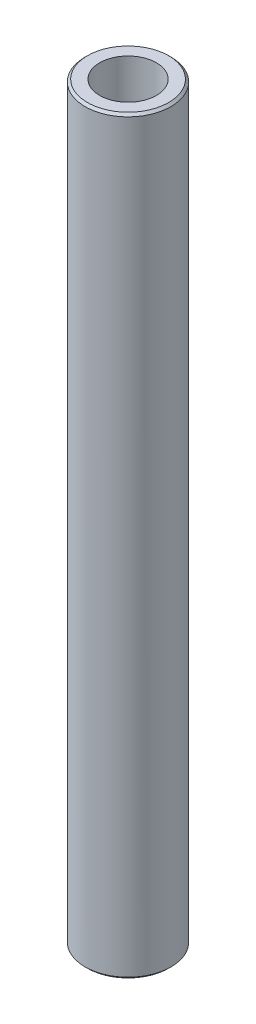
ISO-10303-21;
HEADER;
FILE_DESCRIPTION(('STEP AP214'),'2;1');
FILE_NAME('part.step','',(''),(''),'','','');
FILE_SCHEMA(('AUTOMOTIVE_DESIGN { 1 0 10303 214 1 1 1 1 }'));
ENDSEC;
DATA;
#1=APPLICATION_CONTEXT('core data for automotive mechanical design processes');
#2=APPLICATION_PROTOCOL_DEFINITION('international standard','automotive_design',2000,#1);
#3=PRODUCT_CONTEXT('',#1,'mechanical');
#4=PRODUCT('Part','Part','',(#3));
#5=PRODUCT_RELATED_PRODUCT_CATEGORY('part','',(#4));
#6=PRODUCT_DEFINITION_FORMATION('','',#4);
#7=PRODUCT_DEFINITION_CONTEXT('part definition',#1,'design');
#8=PRODUCT_DEFINITION('design','',#6,#7);
#9=PRODUCT_DEFINITION_SHAPE('','',#8);
#10=(LENGTH_UNIT() NAMED_UNIT(*) SI_UNIT(.MILLI.,.METRE.));
#11=(NAMED_UNIT(*) PLANE_ANGLE_UNIT() SI_UNIT($,.RADIAN.));
#12=(NAMED_UNIT(*) SI_UNIT($,.STERADIAN.) SOLID_ANGLE_UNIT());
#13=UNCERTAINTY_MEASURE_WITH_UNIT(LENGTH_MEASURE(1.E-05),#10,'distance_accuracy_value','');
#14=(GEOMETRIC_REPRESENTATION_CONTEXT(3) GLOBAL_UNCERTAINTY_ASSIGNED_CONTEXT((#13)) GLOBAL_UNIT_ASSIGNED_CONTEXT((#10,
#11,#12)) REPRESENTATION_CONTEXT('',''));
#15=CARTESIAN_POINT('',(0.,0.,0.));
#16=DIRECTION('',(0.,0.,1.));
#17=DIRECTION('',(1.,0.,0.));
#18=AXIS2_PLACEMENT_3D('',#15,#16,#17);
#19=CARTESIAN_POINT('',(0.,480.079677368258,0.));
#20=DIRECTION('',(0.,-1.,0.));
#21=DIRECTION('',(0.,0.,-1.));
#22=AXIS2_PLACEMENT_3D('',#19,#20,#21);
#23=CYLINDRICAL_SURFACE('',#22,27.5);
#24=CARTESIAN_POINT('',(0.,478.569611475824,0.));
#25=DIRECTION('',(0.,1.,0.));
#26=DIRECTION('',(0.,0.,1.));
#27=AXIS2_PLACEMENT_3D('',#24,#25,#26);
#28=CIRCLE('',#27,27.5);
#29=CARTESIAN_POINT('',(0.,478.569611475824,-27.5));
#30=VERTEX_POINT('',#29);
#31=EDGE_CURVE('E50',#30,#30,#28,.F.);
#32=ORIENTED_EDGE('',*,*,#31,.T.);
#33=EDGE_LOOP('',(#32));
#34=FACE_BOUND('',#33,.T.);
#35=CARTESIAN_POINT('',(0.,1.51006589243341,0.));
#36=DIRECTION('',(0.,1.,0.));
#37=DIRECTION('',(0.,0.,1.));
#38=AXIS2_PLACEMENT_3D('',#35,#36,#37);
#39=CIRCLE('',#38,27.5);
#40=CARTESIAN_POINT('',(0.,1.51006589243341,27.5));
#41=VERTEX_POINT('',#40);
#42=EDGE_CURVE('E51',#41,#41,#39,.T.);
#43=ORIENTED_EDGE('',*,*,#42,.T.);
#44=EDGE_LOOP('',(#43));
#45=FACE_BOUND('',#44,.T.);
#46=ADVANCED_FACE('F39',(#34,#45),#23,.T.);
#47=CARTESIAN_POINT('',(0.,480.079677368258,0.));
#48=DIRECTION('',(0.,1.,0.));
#49=DIRECTION('',(0.,0.,1.));
#50=AXIS2_PLACEMENT_3D('',#47,#48,#49);
#51=PLANE('',#50);
#52=CARTESIAN_POINT('',(0.,480.079677368258,0.));
#53=DIRECTION('',(0.,1.,0.));
#54=DIRECTION('',(0.,0.,1.));
#55=AXIS2_PLACEMENT_3D('',#52,#53,#54);
#56=CIRCLE('',#55,25.9899341075666);
#57=CARTESIAN_POINT('',(0.,480.079677368258,-25.9899341075666));
#58=VERTEX_POINT('',#57);
#59=EDGE_CURVE('E54',#58,#58,#56,.T.);
#60=ORIENTED_EDGE('',*,*,#59,.T.);
#61=EDGE_LOOP('',(#60));
#62=FACE_BOUND('',#61,.T.);
#63=CARTESIAN_POINT('',(0.,480.079677368258,0.));
#64=DIRECTION('',(0.,1.,0.));
#65=DIRECTION('',(0.,0.,1.));
#66=AXIS2_PLACEMENT_3D('',#63,#64,#65);
#67=CIRCLE('',#66,18.1618123295571);
#68=CARTESIAN_POINT('',(0.,480.079677368258,18.1618123295571));
#69=VERTEX_POINT('',#68);
#70=EDGE_CURVE('E58',#69,#69,#67,.T.);
#71=ORIENTED_EDGE('',*,*,#70,.F.);
#72=EDGE_LOOP('',(#71));
#73=FACE_BOUND('',#72,.T.);
#74=ADVANCED_FACE('F69',(#62,#73),#51,.T.);
#75=CARTESIAN_POINT('',(0.,0.,0.));
#76=DIRECTION('',(0.,1.,0.));
#77=DIRECTION('',(0.,0.,1.));
#78=AXIS2_PLACEMENT_3D('',#75,#76,#77);
#79=PLANE('',#78);
#80=CARTESIAN_POINT('',(0.,0.,0.));
#81=DIRECTION('',(0.,1.,0.));
#82=DIRECTION('',(0.,0.,1.));
#83=AXIS2_PLACEMENT_3D('',#80,#81,#82);
#84=CIRCLE('',#83,25.9899341075666);
#85=CARTESIAN_POINT('',(0.,0.,25.9899341075666));
#86=VERTEX_POINT('',#85);
#87=EDGE_CURVE('E10',#86,#86,#84,.F.);
#88=ORIENTED_EDGE('',*,*,#87,.T.);
#89=EDGE_LOOP('',(#88));
#90=FACE_BOUND('',#89,.T.);
#91=CARTESIAN_POINT('',(0.,0.,0.));
#92=DIRECTION('',(0.,1.,0.));
#93=DIRECTION('',(0.,0.,1.));
#94=AXIS2_PLACEMENT_3D('',#91,#92,#93);
#95=CIRCLE('',#94,18.1618123295571);
#96=CARTESIAN_POINT('',(0.,0.,18.1618123295571));
#97=VERTEX_POINT('',#96);
#98=EDGE_CURVE('E63',#97,#97,#95,.T.);
#99=ORIENTED_EDGE('',*,*,#98,.T.);
#100=EDGE_LOOP('',(#99));
#101=FACE_BOUND('',#100,.T.);
#102=ADVANCED_FACE('F75',(#90,#101),#79,.F.);
#103=CARTESIAN_POINT('',(0.,480.079677368258,0.));
#104=DIRECTION('',(0.,-1.,0.));
#105=DIRECTION('',(0.,0.,-1.));
#106=AXIS2_PLACEMENT_3D('',#103,#104,#105);
#107=CYLINDRICAL_SURFACE('',#106,18.1618123295571);
#108=ORIENTED_EDGE('',*,*,#70,.T.);
#109=EDGE_LOOP('',(#108));
#110=FACE_BOUND('',#109,.T.);
#111=ORIENTED_EDGE('',*,*,#98,.F.);
#112=EDGE_LOOP('',(#111));
#113=FACE_BOUND('',#112,.T.);
#114=ADVANCED_FACE('F70',(#110,#113),#107,.F.);
#115=CARTESIAN_POINT('',(0.,480.079677368258,0.));
#116=DIRECTION('',(0.,-1.,0.));
#117=DIRECTION('',(0.,0.,-1.));
#118=AXIS2_PLACEMENT_3D('',#115,#116,#117);
#119=CONICAL_SURFACE('',#118,25.9899341075666,0.785398163397423);
#120=CARTESIAN_POINT('',(0.,478.569611475824,-27.5));
#121=CARTESIAN_POINT('',(0.,478.58534132887,-27.4842701469538));
#122=CARTESIAN_POINT('',(0.,478.601071181917,-27.4685402939077));
#123=CARTESIAN_POINT('',(0.,478.632530888009,-27.4370805878153));
#124=CARTESIAN_POINT('',(0.,478.648260741055,-27.4213507347691));
#125=CARTESIAN_POINT('',(0.,478.679720447148,-27.3898910286768));
#126=CARTESIAN_POINT('',(0.,478.695450300194,-27.3741611756306));
#127=CARTESIAN_POINT('',(0.,478.726910006286,-27.3427014695382));
#128=CARTESIAN_POINT('',(0.,478.742639859332,-27.326971616492));
#129=CARTESIAN_POINT('',(0.,478.774099565425,-27.2955119103997));
#130=CARTESIAN_POINT('',(0.,478.789829418471,-27.2797820573535));
#131=CARTESIAN_POINT('',(0.,478.821289124563,-27.2483223512611));
#132=CARTESIAN_POINT('',(0.,478.837018977609,-27.2325924982149));
#133=CARTESIAN_POINT('',(0.,478.868478683702,-27.2011327921226));
#134=CARTESIAN_POINT('',(0.,478.884208536748,-27.1854029390764));
#135=CARTESIAN_POINT('',(0.,478.91566824284,-27.153943232984));
#136=CARTESIAN_POINT('',(0.,478.931398095886,-27.1382133799378));
#137=CARTESIAN_POINT('',(0.,478.962857801979,-27.1067536738455));
#138=CARTESIAN_POINT('',(0.,478.978587655025,-27.0910238207993));
#139=CARTESIAN_POINT('',(0.,479.010047361117,-27.0595641147069));
#140=CARTESIAN_POINT('',(0.,479.025777214164,-27.0438342616608));
#141=CARTESIAN_POINT('',(0.,479.057236920256,-27.0123745555684));
#142=CARTESIAN_POINT('',(0.,479.072966773302,-26.9966447025222));
#143=CARTESIAN_POINT('',(0.,479.104426479394,-26.9651849964299));
#144=CARTESIAN_POINT('',(0.,479.120156332441,-26.9494551433837));
#145=CARTESIAN_POINT('',(0.,479.151616038533,-26.9179954372913));
#146=CARTESIAN_POINT('',(0.,479.167345891579,-26.9022655842451));
#147=CARTESIAN_POINT('',(0.,479.198805597672,-26.8708058781528));
#148=CARTESIAN_POINT('',(0.,479.214535450718,-26.8550760251066));
#149=CARTESIAN_POINT('',(0.,479.24599515681,-26.8236163190142));
#150=CARTESIAN_POINT('',(0.,479.261725009856,-26.807886465968));
#151=CARTESIAN_POINT('',(0.,479.293184715949,-26.7764267598757));
#152=CARTESIAN_POINT('',(0.,479.308914568995,-26.7606969068295));
#153=CARTESIAN_POINT('',(0.,479.340374275087,-26.7292372007371));
#154=CARTESIAN_POINT('',(0.,479.356104128133,-26.7135073476909));
#155=CARTESIAN_POINT('',(0.,479.387563834226,-26.6820476415986));
#156=CARTESIAN_POINT('',(0.,479.403293687272,-26.6663177885524));
#157=CARTESIAN_POINT('',(0.,479.434753393364,-26.63485808246));
#158=CARTESIAN_POINT('',(0.,479.45048324641,-26.6191282294138));
#159=CARTESIAN_POINT('',(0.,479.481942952503,-26.5876685233215));
#160=CARTESIAN_POINT('',(0.,479.497672805549,-26.5719386702753));
#161=CARTESIAN_POINT('',(0.,479.529132511641,-26.540478964183));
#162=CARTESIAN_POINT('',(0.,479.544862364688,-26.5247491111368));
#163=CARTESIAN_POINT('',(0.,479.57632207078,-26.4932894050444));
#164=CARTESIAN_POINT('',(0.,479.592051923826,-26.4775595519982));
#165=CARTESIAN_POINT('',(0.,479.623511629918,-26.4460998459059));
#166=CARTESIAN_POINT('',(0.,479.639241482965,-26.4303699928597));
#167=CARTESIAN_POINT('',(0.,479.670701189057,-26.3989102867673));
#168=CARTESIAN_POINT('',(0.,479.686431042103,-26.3831804337211));
#169=CARTESIAN_POINT('',(0.,479.717890748196,-26.3517207276288));
#170=CARTESIAN_POINT('',(0.,479.733620601242,-26.3359908745826));
#171=CARTESIAN_POINT('',(0.,479.765080307334,-26.3045311684902));
#172=CARTESIAN_POINT('',(0.,479.78081016038,-26.288801315444));
#173=CARTESIAN_POINT('',(0.,479.812269866473,-26.2573416093517));
#174=CARTESIAN_POINT('',(0.,479.827999719519,-26.2416117563055));
#175=CARTESIAN_POINT('',(0.,479.859459425611,-26.2101520502131));
#176=CARTESIAN_POINT('',(0.,479.875189278657,-26.1944221971669));
#177=CARTESIAN_POINT('',(0.,479.90664898475,-26.1629624910746));
#178=CARTESIAN_POINT('',(0.,479.922378837796,-26.1472326380284));
#179=CARTESIAN_POINT('',(0.,479.953838543888,-26.115772931936));
#180=CARTESIAN_POINT('',(0.,479.969568396935,-26.1000430788899));
#181=CARTESIAN_POINT('',(0.,480.001028103027,-26.0685833727975));
#182=CARTESIAN_POINT('',(0.,480.016757956073,-26.0528535197513));
#183=CARTESIAN_POINT('',(0.,480.048217662165,-26.021393813659));
#184=CARTESIAN_POINT('',(0.,480.063947515212,-26.0056639606128));
#185=CARTESIAN_POINT('',(0.,480.079677368258,-25.9899341075666));
#186=B_SPLINE_CURVE_WITH_KNOTS('',3,(#120,#121,#122,#123,#124,#125,#126,#127,#128,#129,#130,
#131,#132,#133,#134,#135,#136,#137,#138,#139,#140,#141,#142,#143,#144,#145,#146,#147,#148,#149,
#150,#151,#152,#153,#154,#155,#156,#157,#158,#159,#160,#161,#162,#163,#164,#165,#166,#167,#168,
#169,#170,#171,#172,#173,#174,#175,#176,#177,#178,#179,#180,#181,#182,#183,#184,#185),
.UNSPECIFIED.,.F.,.F.,(4,2,2,2,2,2,2,2,2,2,2,2,2,2,2,2,2,2,2,2,2,2,2,2,2,2,2,2,2,2,2,2,4),(0.,
0.0667361145361166,0.133472229072275,0.200208343608392,0.266944458144547,0.333680572680666,
0.400416687216822,0.467152801752939,0.533888916289095,0.600625030825253,0.66736114536137,
0.734097259897526,0.800833374433645,0.867569488969801,0.934305603505917,1.00104171804208,
1.06777783257823,1.13451394711435,1.20125006165051,1.26798617618662,1.33472229072278,
1.4014584052589,1.46819451979505,1.53493063433117,1.60166674886733,1.66840286340348,
1.7351389779396,1.80187509247576,1.86861120701188,1.93534732154803,2.00208343608415,
2.06881955062031,2.13555566515646),.UNSPECIFIED.);
#187=EDGE_CURVE('BSEAM81',#30,#58,#186,.T.);
#188=ORIENTED_EDGE('',*,*,#31,.F.);
#189=ORIENTED_EDGE('',*,*,#59,.F.);
#190=ORIENTED_EDGE('',*,*,#187,.T.);
#191=ORIENTED_EDGE('',*,*,#187,.F.);
#192=EDGE_LOOP('',(#188,#190,#189,#191));
#193=FACE_BOUND('',#192,.T.);
#194=ADVANCED_FACE('F81',(#193),#119,.T.);
#195=CARTESIAN_POINT('',(0.,1.51006589243341,0.));
#196=DIRECTION('',(0.,1.,0.));
#197=DIRECTION('',(0.,0.,1.));
#198=AXIS2_PLACEMENT_3D('',#195,#196,#197);
#199=CONICAL_SURFACE('',#198,27.5,0.785398163397441);
#200=ORIENTED_EDGE('',*,*,#87,.F.);
#201=EDGE_LOOP('',(#200));
#202=FACE_BOUND('',#201,.T.);
#203=ORIENTED_EDGE('',*,*,#42,.F.);
#204=EDGE_LOOP('',(#203));
#205=FACE_BOUND('',#204,.T.);
#206=ADVANCED_FACE('F45',(#202,#205),#199,.T.);
#207=CLOSED_SHELL('',(#46,#74,#102,#114,#194,#206));
#208=MANIFOLD_SOLID_BREP('B2',#207);
#209=ADVANCED_BREP_SHAPE_REPRESENTATION('',(#18,#208),#14);
#210=SHAPE_DEFINITION_REPRESENTATION(#9,#209);
ENDSEC;
END-ISO-10303-21;
